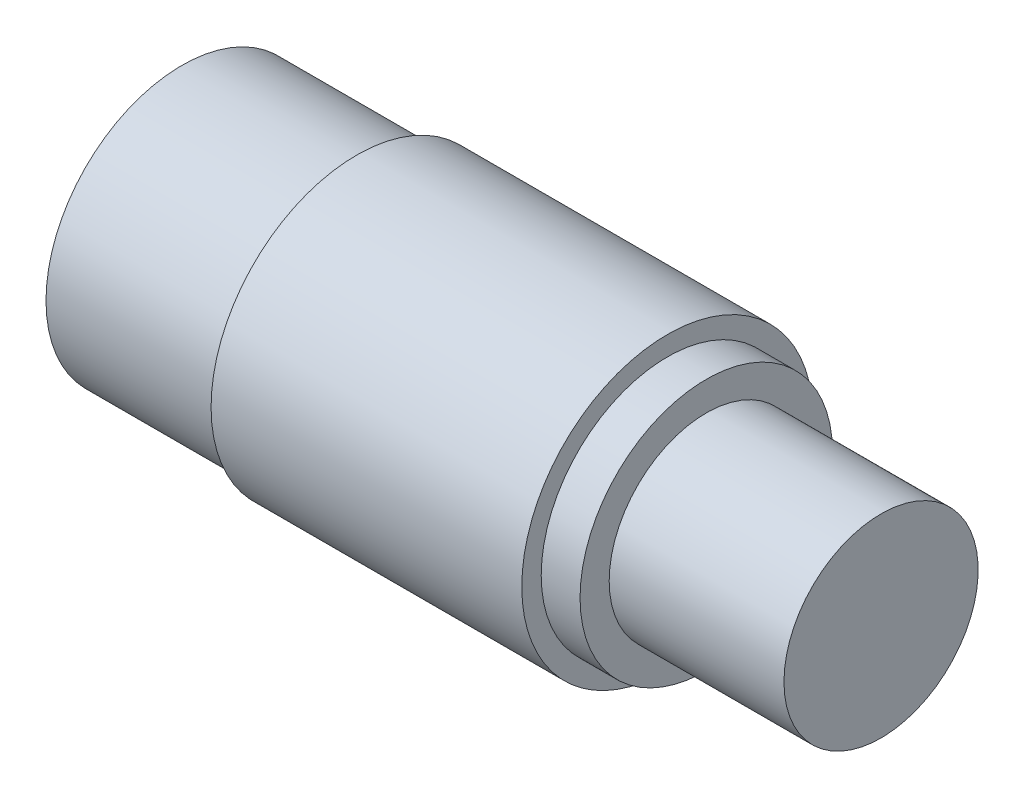
ISO-10303-21;
HEADER;
FILE_DESCRIPTION(('STEP AP214'),'2;1');
FILE_NAME('part.step','',(''),(''),'','','');
FILE_SCHEMA(('AUTOMOTIVE_DESIGN { 1 0 10303 214 1 1 1 1 }'));
ENDSEC;
DATA;
#1=APPLICATION_CONTEXT('core data for automotive mechanical design processes');
#2=APPLICATION_PROTOCOL_DEFINITION('international standard','automotive_design',2000,#1);
#3=PRODUCT_CONTEXT('',#1,'mechanical');
#4=PRODUCT('Part','Part','',(#3));
#5=PRODUCT_RELATED_PRODUCT_CATEGORY('part','',(#4));
#6=PRODUCT_DEFINITION_FORMATION('','',#4);
#7=PRODUCT_DEFINITION_CONTEXT('part definition',#1,'design');
#8=PRODUCT_DEFINITION('design','',#6,#7);
#9=PRODUCT_DEFINITION_SHAPE('','',#8);
#10=(LENGTH_UNIT() NAMED_UNIT(*) SI_UNIT(.MILLI.,.METRE.));
#11=(NAMED_UNIT(*) PLANE_ANGLE_UNIT() SI_UNIT($,.RADIAN.));
#12=(NAMED_UNIT(*) SI_UNIT($,.STERADIAN.) SOLID_ANGLE_UNIT());
#13=UNCERTAINTY_MEASURE_WITH_UNIT(LENGTH_MEASURE(1.E-05),#10,'distance_accuracy_value','');
#14=(GEOMETRIC_REPRESENTATION_CONTEXT(3) GLOBAL_UNCERTAINTY_ASSIGNED_CONTEXT((#13)) GLOBAL_UNIT_ASSIGNED_CONTEXT((#10,
#11,#12)) REPRESENTATION_CONTEXT('',''));
#15=CARTESIAN_POINT('',(0.,0.,0.));
#16=DIRECTION('',(0.,0.,1.));
#17=DIRECTION('',(1.,0.,0.));
#18=AXIS2_PLACEMENT_3D('',#15,#16,#17);
#19=CARTESIAN_POINT('',(-18.,0.,0.));
#20=DIRECTION('',(1.,0.,0.));
#21=DIRECTION('',(0.,0.,-1.));
#22=AXIS2_PLACEMENT_3D('',#19,#20,#21);
#23=PLANE('',#22);
#24=CARTESIAN_POINT('',(-18.,0.,0.));
#25=DIRECTION('',(-1.,0.,0.));
#26=DIRECTION('',(0.,0.,1.));
#27=AXIS2_PLACEMENT_3D('',#24,#25,#26);
#28=CIRCLE('',#27,7.);
#29=CARTESIAN_POINT('',(-18.,0.,7.));
#30=VERTEX_POINT('',#29);
#31=EDGE_CURVE('E10',#30,#30,#28,.T.);
#32=ORIENTED_EDGE('',*,*,#31,.T.);
#33=EDGE_LOOP('',(#32));
#34=FACE_BOUND('',#33,.T.);
#35=ADVANCED_FACE('F31',(#34),#23,.F.);
#36=CARTESIAN_POINT('',(-48.3350201864221,0.,0.));
#37=DIRECTION('',(-1.,0.,0.));
#38=DIRECTION('',(0.,0.,1.));
#39=AXIS2_PLACEMENT_3D('',#36,#37,#38);
#40=CYLINDRICAL_SURFACE('',#39,7.);
#41=ORIENTED_EDGE('',*,*,#31,.F.);
#42=EDGE_LOOP('',(#41));
#43=FACE_BOUND('',#42,.T.);
#44=CARTESIAN_POINT('',(-9.00000000000001,0.,0.));
#45=DIRECTION('',(-1.,0.,0.));
#46=DIRECTION('',(0.,0.,1.));
#47=AXIS2_PLACEMENT_3D('',#44,#45,#46);
#48=CIRCLE('',#47,7.);
#49=CARTESIAN_POINT('',(-9.00000000000001,0.,7.));
#50=VERTEX_POINT('',#49);
#51=EDGE_CURVE('E37',#50,#50,#48,.T.);
#52=ORIENTED_EDGE('',*,*,#51,.T.);
#53=EDGE_LOOP('',(#52));
#54=FACE_BOUND('',#53,.T.);
#55=ADVANCED_FACE('F75',(#43,#54),#40,.T.);
#56=CARTESIAN_POINT('',(-9.00000000000001,7.,0.));
#57=DIRECTION('',(1.,0.,0.));
#58=DIRECTION('',(0.,0.,-1.));
#59=AXIS2_PLACEMENT_3D('',#56,#57,#58);
#60=PLANE('',#59);
#61=ORIENTED_EDGE('',*,*,#51,.F.);
#62=EDGE_LOOP('',(#61));
#63=FACE_BOUND('',#62,.T.);
#64=CARTESIAN_POINT('',(-9.00000000000001,0.,0.));
#65=DIRECTION('',(-1.,0.,0.));
#66=DIRECTION('',(0.,0.,1.));
#67=AXIS2_PLACEMENT_3D('',#64,#65,#66);
#68=CIRCLE('',#67,7.5);
#69=CARTESIAN_POINT('',(-9.00000000000001,0.,7.5));
#70=VERTEX_POINT('',#69);
#71=EDGE_CURVE('E41',#70,#70,#68,.T.);
#72=ORIENTED_EDGE('',*,*,#71,.T.);
#73=EDGE_LOOP('',(#72));
#74=FACE_BOUND('',#73,.T.);
#75=ADVANCED_FACE('F79',(#63,#74),#60,.F.);
#76=CARTESIAN_POINT('',(-48.3350201864221,0.,0.));
#77=DIRECTION('',(-1.,0.,0.));
#78=DIRECTION('',(0.,0.,1.));
#79=AXIS2_PLACEMENT_3D('',#76,#77,#78);
#80=CYLINDRICAL_SURFACE('',#79,7.5);
#81=ORIENTED_EDGE('',*,*,#71,.F.);
#82=EDGE_LOOP('',(#81));
#83=FACE_BOUND('',#82,.T.);
#84=CARTESIAN_POINT('',(6.99999999999999,0.,0.));
#85=DIRECTION('',(-1.,0.,0.));
#86=DIRECTION('',(0.,0.,1.));
#87=AXIS2_PLACEMENT_3D('',#84,#85,#86);
#88=CIRCLE('',#87,7.5);
#89=CARTESIAN_POINT('',(6.99999999999999,0.,7.5));
#90=VERTEX_POINT('',#89);
#91=EDGE_CURVE('E45',#90,#90,#88,.T.);
#92=ORIENTED_EDGE('',*,*,#91,.T.);
#93=EDGE_LOOP('',(#92));
#94=FACE_BOUND('',#93,.T.);
#95=ADVANCED_FACE('F84',(#83,#94),#80,.T.);
#96=CARTESIAN_POINT('',(6.99999999999999,7.5,0.));
#97=DIRECTION('',(-1.,0.,0.));
#98=DIRECTION('',(0.,0.,1.));
#99=AXIS2_PLACEMENT_3D('',#96,#97,#98);
#100=PLANE('',#99);
#101=ORIENTED_EDGE('',*,*,#91,.F.);
#102=EDGE_LOOP('',(#101));
#103=FACE_BOUND('',#102,.T.);
#104=CARTESIAN_POINT('',(6.99999999999999,0.,0.));
#105=DIRECTION('',(-1.,0.,0.));
#106=DIRECTION('',(0.,0.,1.));
#107=AXIS2_PLACEMENT_3D('',#104,#105,#106);
#108=CIRCLE('',#107,6.5);
#109=CARTESIAN_POINT('',(6.99999999999999,0.,6.5));
#110=VERTEX_POINT('',#109);
#111=EDGE_CURVE('E50',#110,#110,#108,.T.);
#112=ORIENTED_EDGE('',*,*,#111,.T.);
#113=EDGE_LOOP('',(#112));
#114=FACE_BOUND('',#113,.T.);
#115=ADVANCED_FACE('F90',(#103,#114),#100,.F.);
#116=CARTESIAN_POINT('',(-48.3350201864221,0.,0.));
#117=DIRECTION('',(-1.,0.,0.));
#118=DIRECTION('',(0.,0.,1.));
#119=AXIS2_PLACEMENT_3D('',#116,#117,#118);
#120=CYLINDRICAL_SURFACE('',#119,6.5);
#121=ORIENTED_EDGE('',*,*,#111,.F.);
#122=EDGE_LOOP('',(#121));
#123=FACE_BOUND('',#122,.T.);
#124=CARTESIAN_POINT('',(8.99999999999999,0.,0.));
#125=DIRECTION('',(-1.,0.,0.));
#126=DIRECTION('',(0.,0.,1.));
#127=AXIS2_PLACEMENT_3D('',#124,#125,#126);
#128=CIRCLE('',#127,6.5);
#129=CARTESIAN_POINT('',(8.99999999999999,0.,6.5));
#130=VERTEX_POINT('',#129);
#131=EDGE_CURVE('E53',#130,#130,#128,.T.);
#132=ORIENTED_EDGE('',*,*,#131,.T.);
#133=EDGE_LOOP('',(#132));
#134=FACE_BOUND('',#133,.T.);
#135=ADVANCED_FACE('F94',(#123,#134),#120,.T.);
#136=CARTESIAN_POINT('',(9.,6.5,0.));
#137=DIRECTION('',(-1.,0.,0.));
#138=DIRECTION('',(0.,0.,1.));
#139=AXIS2_PLACEMENT_3D('',#136,#137,#138);
#140=PLANE('',#139);
#141=ORIENTED_EDGE('',*,*,#131,.F.);
#142=EDGE_LOOP('',(#141));
#143=FACE_BOUND('',#142,.T.);
#144=CARTESIAN_POINT('',(9.00000000000001,0.,0.));
#145=DIRECTION('',(-1.,0.,0.));
#146=DIRECTION('',(0.,0.,1.));
#147=AXIS2_PLACEMENT_3D('',#144,#145,#146);
#148=CIRCLE('',#147,5.);
#149=CARTESIAN_POINT('',(9.00000000000001,0.,5.));
#150=VERTEX_POINT('',#149);
#151=EDGE_CURVE('E56',#150,#150,#148,.T.);
#152=ORIENTED_EDGE('',*,*,#151,.T.);
#153=EDGE_LOOP('',(#152));
#154=FACE_BOUND('',#153,.T.);
#155=ADVANCED_FACE('F71',(#143,#154),#140,.F.);
#156=CARTESIAN_POINT('',(-48.3350201864221,0.,0.));
#157=DIRECTION('',(-1.,0.,0.));
#158=DIRECTION('',(0.,0.,1.));
#159=AXIS2_PLACEMENT_3D('',#156,#157,#158);
#160=CYLINDRICAL_SURFACE('',#159,5.);
#161=ORIENTED_EDGE('',*,*,#151,.F.);
#162=EDGE_LOOP('',(#161));
#163=FACE_BOUND('',#162,.T.);
#164=CARTESIAN_POINT('',(18.,0.,0.));
#165=DIRECTION('',(-1.,0.,0.));
#166=DIRECTION('',(0.,0.,1.));
#167=AXIS2_PLACEMENT_3D('',#164,#165,#166);
#168=CIRCLE('',#167,5.);
#169=CARTESIAN_POINT('',(18.,0.,5.));
#170=VERTEX_POINT('',#169);
#171=EDGE_CURVE('E59',#170,#170,#168,.T.);
#172=ORIENTED_EDGE('',*,*,#171,.T.);
#173=EDGE_LOOP('',(#172));
#174=FACE_BOUND('',#173,.T.);
#175=ADVANCED_FACE('F63',(#163,#174),#160,.T.);
#176=CARTESIAN_POINT('',(18.,5.,0.));
#177=DIRECTION('',(-1.,0.,0.));
#178=DIRECTION('',(0.,0.,1.));
#179=AXIS2_PLACEMENT_3D('',#176,#177,#178);
#180=PLANE('',#179);
#181=ORIENTED_EDGE('',*,*,#171,.F.);
#182=EDGE_LOOP('',(#181));
#183=FACE_BOUND('',#182,.T.);
#184=ADVANCED_FACE('F65',(#183),#180,.F.);
#185=CLOSED_SHELL('',(#35,#55,#75,#95,#115,#135,#155,#175,#184));
#186=MANIFOLD_SOLID_BREP('B2',#185);
#187=ADVANCED_BREP_SHAPE_REPRESENTATION('',(#18,#186),#14);
#188=SHAPE_DEFINITION_REPRESENTATION(#9,#187);
ENDSEC;
END-ISO-10303-21;
